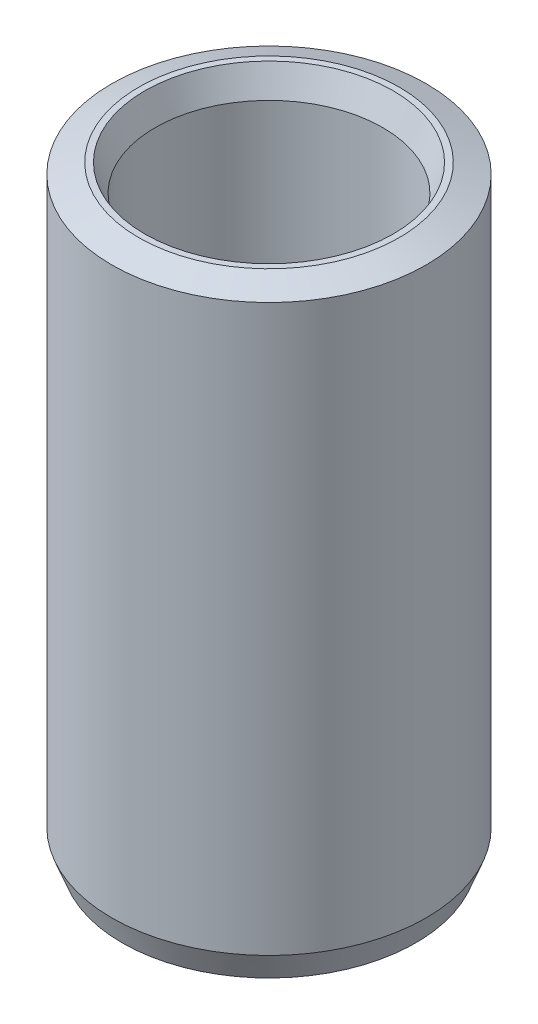
ISO-10303-21;
HEADER;
FILE_DESCRIPTION(('STEP AP214'),'2;1');
FILE_NAME('part.step','',(''),(''),'','','');
FILE_SCHEMA(('AUTOMOTIVE_DESIGN { 1 0 10303 214 1 1 1 1 }'));
ENDSEC;
DATA;
#1=APPLICATION_CONTEXT('core data for automotive mechanical design processes');
#2=APPLICATION_PROTOCOL_DEFINITION('international standard','automotive_design',2000,#1);
#3=PRODUCT_CONTEXT('',#1,'mechanical');
#4=PRODUCT('Part','Part','',(#3));
#5=PRODUCT_RELATED_PRODUCT_CATEGORY('part','',(#4));
#6=PRODUCT_DEFINITION_FORMATION('','',#4);
#7=PRODUCT_DEFINITION_CONTEXT('part definition',#1,'design');
#8=PRODUCT_DEFINITION('design','',#6,#7);
#9=PRODUCT_DEFINITION_SHAPE('','',#8);
#10=(LENGTH_UNIT() NAMED_UNIT(*) SI_UNIT(.MILLI.,.METRE.));
#11=(NAMED_UNIT(*) PLANE_ANGLE_UNIT() SI_UNIT($,.RADIAN.));
#12=(NAMED_UNIT(*) SI_UNIT($,.STERADIAN.) SOLID_ANGLE_UNIT());
#13=UNCERTAINTY_MEASURE_WITH_UNIT(LENGTH_MEASURE(1.E-05),#10,'distance_accuracy_value','');
#14=(GEOMETRIC_REPRESENTATION_CONTEXT(3) GLOBAL_UNCERTAINTY_ASSIGNED_CONTEXT((#13)) GLOBAL_UNIT_ASSIGNED_CONTEXT((#10,
#11,#12)) REPRESENTATION_CONTEXT('',''));
#15=CARTESIAN_POINT('',(0.,0.,0.));
#16=DIRECTION('',(0.,0.,1.));
#17=DIRECTION('',(1.,0.,0.));
#18=AXIS2_PLACEMENT_3D('',#15,#16,#17);
#19=CARTESIAN_POINT('',(0.,191.758409540004,0.));
#20=DIRECTION('',(0.,-1.,0.));
#21=DIRECTION('',(0.,0.,-1.));
#22=AXIS2_PLACEMENT_3D('',#19,#20,#21);
#23=CYLINDRICAL_SURFACE('',#22,50.);
#24=CARTESIAN_POINT('',(0.,8.52224481714128,0.));
#25=DIRECTION('',(0.,1.,0.));
#26=DIRECTION('',(0.,0.,1.));
#27=AXIS2_PLACEMENT_3D('',#24,#25,#26);
#28=CIRCLE('',#27,50.);
#29=CARTESIAN_POINT('',(0.,8.52224481714128,50.));
#30=VERTEX_POINT('',#29);
#31=EDGE_CURVE('E10',#30,#30,#28,.T.);
#32=ORIENTED_EDGE('',*,*,#31,.T.);
#33=EDGE_LOOP('',(#32));
#34=FACE_BOUND('',#33,.T.);
#35=CARTESIAN_POINT('',(0.,188.47986935682,0.));
#36=DIRECTION('',(0.,1.,0.));
#37=DIRECTION('',(0.,0.,1.));
#38=AXIS2_PLACEMENT_3D('',#35,#36,#37);
#39=CIRCLE('',#38,50.);
#40=CARTESIAN_POINT('',(0.,188.47986935682,50.));
#41=VERTEX_POINT('',#40);
#42=EDGE_CURVE('E50',#41,#41,#39,.F.);
#43=ORIENTED_EDGE('',*,*,#42,.T.);
#44=EDGE_LOOP('',(#43));
#45=FACE_BOUND('',#44,.T.);
#46=ADVANCED_FACE('F39',(#34,#45),#23,.T.);
#47=CARTESIAN_POINT('',(0.,191.758409540004,0.));
#48=DIRECTION('',(0.,1.,0.));
#49=DIRECTION('',(0.,0.,1.));
#50=AXIS2_PLACEMENT_3D('',#47,#48,#49);
#51=PLANE('',#50);
#52=CARTESIAN_POINT('',(0.,191.758409540004,0.));
#53=DIRECTION('',(0.,1.,0.));
#54=DIRECTION('',(0.,0.,1.));
#55=AXIS2_PLACEMENT_3D('',#52,#53,#54);
#56=CIRCLE('',#55,39.5067764058485);
#57=CARTESIAN_POINT('',(0.,191.758409540004,39.5067764058485));
#58=VERTEX_POINT('',#57);
#59=EDGE_CURVE('E58',#58,#58,#56,.F.);
#60=ORIENTED_EDGE('',*,*,#59,.T.);
#61=EDGE_LOOP('',(#60));
#62=FACE_BOUND('',#61,.T.);
#63=CARTESIAN_POINT('',(0.,191.758409540004,0.));
#64=DIRECTION('',(0.,1.,0.));
#65=DIRECTION('',(0.,0.,1.));
#66=AXIS2_PLACEMENT_3D('',#63,#64,#65);
#67=CIRCLE('',#66,41.4777551828587);
#68=CARTESIAN_POINT('',(0.,191.758409540004,41.4777551828587));
#69=VERTEX_POINT('',#68);
#70=EDGE_CURVE('E61',#69,#69,#67,.T.);
#71=ORIENTED_EDGE('',*,*,#70,.T.);
#72=EDGE_LOOP('',(#71));
#73=FACE_BOUND('',#72,.T.);
#74=ADVANCED_FACE('F88',(#62,#73),#51,.T.);
#75=CARTESIAN_POINT('',(0.,0.,0.));
#76=DIRECTION('',(0.,1.,0.));
#77=DIRECTION('',(0.,0.,1.));
#78=AXIS2_PLACEMENT_3D('',#75,#76,#77);
#79=PLANE('',#78);
#80=CARTESIAN_POINT('',(0.,0.,0.));
#81=DIRECTION('',(0.,1.,0.));
#82=DIRECTION('',(0.,0.,1.));
#83=AXIS2_PLACEMENT_3D('',#80,#81,#82);
#84=CIRCLE('',#83,44.7504810398054);
#85=CARTESIAN_POINT('',(0.,0.,44.7504810398054));
#86=VERTEX_POINT('',#85);
#87=EDGE_CURVE('E51',#86,#86,#84,.T.);
#88=ORIENTED_EDGE('',*,*,#87,.T.);
#89=EDGE_LOOP('',(#88));
#90=FACE_BOUND('',#89,.T.);
#91=CARTESIAN_POINT('',(0.,0.,0.));
#92=DIRECTION('',(0.,1.,0.));
#93=DIRECTION('',(0.,0.,1.));
#94=AXIS2_PLACEMENT_3D('',#91,#92,#93);
#95=CIRCLE('',#94,46.7214598168157);
#96=CARTESIAN_POINT('',(0.,0.,46.7214598168157));
#97=VERTEX_POINT('',#96);
#98=EDGE_CURVE('E54',#97,#97,#95,.F.);
#99=ORIENTED_EDGE('',*,*,#98,.T.);
#100=EDGE_LOOP('',(#99));
#101=FACE_BOUND('',#100,.T.);
#102=ADVANCED_FACE('F83',(#90,#101),#79,.F.);
#103=CARTESIAN_POINT('',(0.,191.758409540004,0.));
#104=DIRECTION('',(0.,-1.,0.));
#105=DIRECTION('',(0.,0.,-1.));
#106=AXIS2_PLACEMENT_3D('',#103,#104,#105);
#107=CYLINDRICAL_SURFACE('',#106,36.2282362226641);
#108=CARTESIAN_POINT('',(0.,183.236164722863,0.));
#109=DIRECTION('',(0.,1.,0.));
#110=DIRECTION('',(0.,0.,1.));
#111=AXIS2_PLACEMENT_3D('',#108,#109,#110);
#112=CIRCLE('',#111,36.2282362226641);
#113=CARTESIAN_POINT('',(0.,183.236164722863,36.2282362226641));
#114=VERTEX_POINT('',#113);
#115=EDGE_CURVE('E67',#114,#114,#112,.T.);
#116=ORIENTED_EDGE('',*,*,#115,.T.);
#117=EDGE_LOOP('',(#116));
#118=FACE_BOUND('',#117,.T.);
#119=CARTESIAN_POINT('',(0.,3.27854018318435,0.));
#120=DIRECTION('',(0.,1.,0.));
#121=DIRECTION('',(0.,0.,1.));
#122=AXIS2_PLACEMENT_3D('',#119,#120,#121);
#123=CIRCLE('',#122,36.2282362226641);
#124=CARTESIAN_POINT('',(0.,3.27854018318435,36.2282362226641));
#125=VERTEX_POINT('',#124);
#126=EDGE_CURVE('E69',#125,#125,#123,.F.);
#127=ORIENTED_EDGE('',*,*,#126,.T.);
#128=EDGE_LOOP('',(#127));
#129=FACE_BOUND('',#128,.T.);
#130=ADVANCED_FACE('F71',(#118,#129),#107,.F.);
#131=CARTESIAN_POINT('',(0.,183.236164722863,0.));
#132=DIRECTION('',(0.,1.,0.));
#133=DIRECTION('',(0.,0.,1.));
#134=AXIS2_PLACEMENT_3D('',#131,#132,#133);
#135=CONICAL_SURFACE('',#134,36.2282362226641,0.367250875417206);
#136=ORIENTED_EDGE('',*,*,#59,.F.);
#137=EDGE_LOOP('',(#136));
#138=FACE_BOUND('',#137,.T.);
#139=ORIENTED_EDGE('',*,*,#115,.F.);
#140=EDGE_LOOP('',(#139));
#141=FACE_BOUND('',#140,.T.);
#142=ADVANCED_FACE('F77',(#138,#141),#135,.F.);
#143=CARTESIAN_POINT('',(0.,0.,0.));
#144=DIRECTION('',(0.,-1.,0.));
#145=DIRECTION('',(0.,0.,-1.));
#146=AXIS2_PLACEMENT_3D('',#143,#144,#145);
#147=CONICAL_SURFACE('',#146,44.7504810398054,1.20354545137769);
#148=ORIENTED_EDGE('',*,*,#126,.F.);
#149=EDGE_LOOP('',(#148));
#150=FACE_BOUND('',#149,.T.);
#151=ORIENTED_EDGE('',*,*,#87,.F.);
#152=EDGE_LOOP('',(#151));
#153=FACE_BOUND('',#152,.T.);
#154=ADVANCED_FACE('F73',(#150,#153),#147,.F.);
#155=CARTESIAN_POINT('',(0.,8.52224481714128,0.));
#156=DIRECTION('',(0.,1.,0.));
#157=DIRECTION('',(0.,0.,1.));
#158=AXIS2_PLACEMENT_3D('',#155,#156,#157);
#159=CONICAL_SURFACE('',#158,50.,0.36725087541721);
#160=ORIENTED_EDGE('',*,*,#98,.F.);
#161=EDGE_LOOP('',(#160));
#162=FACE_BOUND('',#161,.T.);
#163=ORIENTED_EDGE('',*,*,#31,.F.);
#164=EDGE_LOOP('',(#163));
#165=FACE_BOUND('',#164,.T.);
#166=ADVANCED_FACE('F76',(#162,#165),#159,.T.);
#167=CARTESIAN_POINT('',(0.,191.758409540004,0.));
#168=DIRECTION('',(0.,-1.,0.));
#169=DIRECTION('',(0.,0.,-1.));
#170=AXIS2_PLACEMENT_3D('',#167,#168,#169);
#171=CONICAL_SURFACE('',#170,41.4777551828587,1.20354545137769);
#172=ORIENTED_EDGE('',*,*,#42,.F.);
#173=EDGE_LOOP('',(#172));
#174=FACE_BOUND('',#173,.T.);
#175=ORIENTED_EDGE('',*,*,#70,.F.);
#176=EDGE_LOOP('',(#175));
#177=FACE_BOUND('',#176,.T.);
#178=ADVANCED_FACE('F45',(#174,#177),#171,.T.);
#179=CLOSED_SHELL('',(#46,#74,#102,#130,#142,#154,#166,#178));
#180=MANIFOLD_SOLID_BREP('B2',#179);
#181=ADVANCED_BREP_SHAPE_REPRESENTATION('',(#18,#180),#14);
#182=SHAPE_DEFINITION_REPRESENTATION(#9,#181);
ENDSEC;
END-ISO-10303-21;
